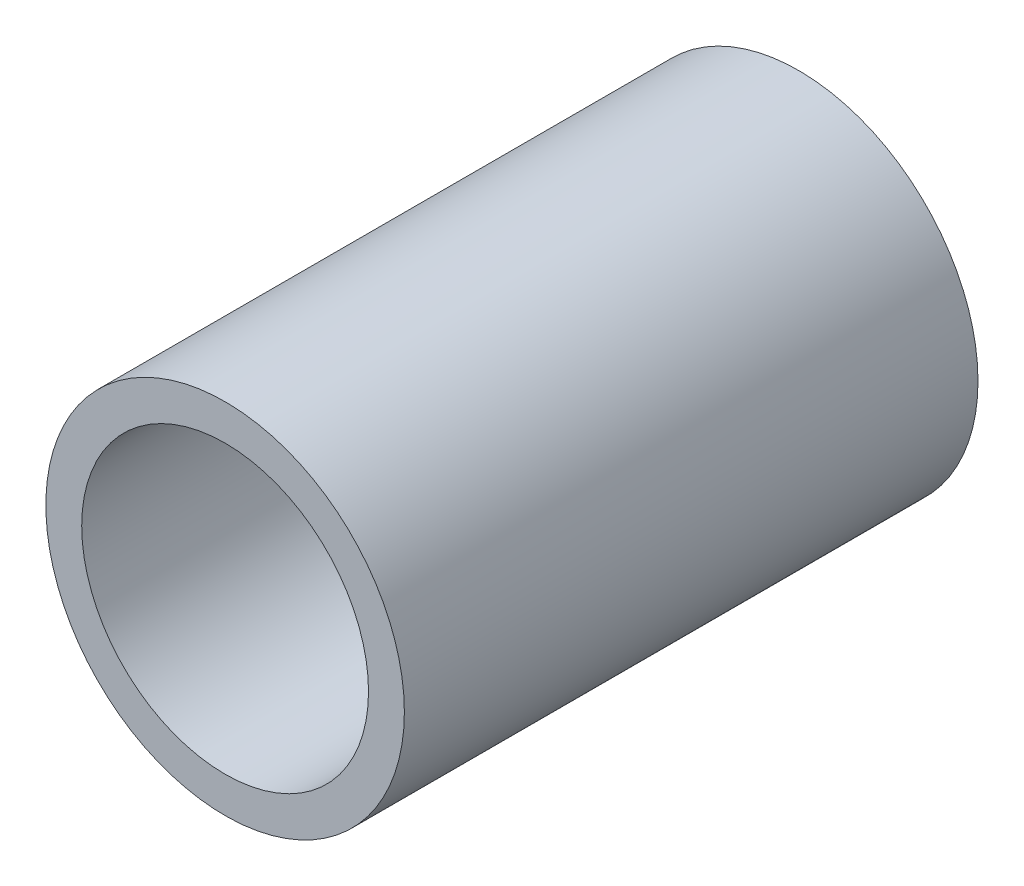
ISO-10303-21;
HEADER;
FILE_DESCRIPTION(('STEP AP214'),'2;1');
FILE_NAME('part.step','',(''),(''),'','','');
FILE_SCHEMA(('AUTOMOTIVE_DESIGN { 1 0 10303 214 1 1 1 1 }'));
ENDSEC;
DATA;
#1=APPLICATION_CONTEXT('core data for automotive mechanical design processes');
#2=APPLICATION_PROTOCOL_DEFINITION('international standard','automotive_design',2000,#1);
#3=PRODUCT_CONTEXT('',#1,'mechanical');
#4=PRODUCT('Part','Part','',(#3));
#5=PRODUCT_RELATED_PRODUCT_CATEGORY('part','',(#4));
#6=PRODUCT_DEFINITION_FORMATION('','',#4);
#7=PRODUCT_DEFINITION_CONTEXT('part definition',#1,'design');
#8=PRODUCT_DEFINITION('design','',#6,#7);
#9=PRODUCT_DEFINITION_SHAPE('','',#8);
#10=(LENGTH_UNIT() NAMED_UNIT(*) SI_UNIT(.MILLI.,.METRE.));
#11=(NAMED_UNIT(*) PLANE_ANGLE_UNIT() SI_UNIT($,.RADIAN.));
#12=(NAMED_UNIT(*) SI_UNIT($,.STERADIAN.) SOLID_ANGLE_UNIT());
#13=UNCERTAINTY_MEASURE_WITH_UNIT(LENGTH_MEASURE(1.E-05),#10,'distance_accuracy_value','');
#14=(GEOMETRIC_REPRESENTATION_CONTEXT(3) GLOBAL_UNCERTAINTY_ASSIGNED_CONTEXT((#13)) GLOBAL_UNIT_ASSIGNED_CONTEXT((#10,
#11,#12)) REPRESENTATION_CONTEXT('',''));
#15=CARTESIAN_POINT('',(0.,0.,0.));
#16=DIRECTION('',(0.,0.,1.));
#17=DIRECTION('',(1.,0.,0.));
#18=AXIS2_PLACEMENT_3D('',#15,#16,#17);
#19=CARTESIAN_POINT('',(0.,0.,12.7));
#20=DIRECTION('',(0.,0.,1.));
#21=DIRECTION('',(1.,0.,0.));
#22=AXIS2_PLACEMENT_3D('',#19,#20,#21);
#23=PLANE('',#22);
#24=CARTESIAN_POINT('',(0.,0.,12.7));
#25=DIRECTION('',(0.,0.,1.));
#26=DIRECTION('',(1.,0.,0.));
#27=AXIS2_PLACEMENT_3D('',#24,#25,#26);
#28=CIRCLE('',#27,3.96875);
#29=CARTESIAN_POINT('',(3.96875,0.,12.7));
#30=VERTEX_POINT('',#29);
#31=EDGE_CURVE('E10',#30,#30,#28,.T.);
#32=ORIENTED_EDGE('',*,*,#31,.T.);
#33=EDGE_LOOP('',(#32));
#34=FACE_BOUND('',#33,.T.);
#35=CARTESIAN_POINT('',(0.,0.,12.7));
#36=DIRECTION('',(0.,0.,1.));
#37=DIRECTION('',(1.,0.,0.));
#38=AXIS2_PLACEMENT_3D('',#35,#36,#37);
#39=CIRCLE('',#38,3.175);
#40=CARTESIAN_POINT('',(3.175,0.,12.7));
#41=VERTEX_POINT('',#40);
#42=EDGE_CURVE('E41',#41,#41,#39,.T.);
#43=ORIENTED_EDGE('',*,*,#42,.F.);
#44=EDGE_LOOP('',(#43));
#45=FACE_BOUND('',#44,.T.);
#46=ADVANCED_FACE('F30',(#34,#45),#23,.T.);
#47=CARTESIAN_POINT('',(0.,0.,0.));
#48=DIRECTION('',(0.,0.,1.));
#49=DIRECTION('',(1.,0.,0.));
#50=AXIS2_PLACEMENT_3D('',#47,#48,#49);
#51=PLANE('',#50);
#52=CARTESIAN_POINT('',(0.,0.,0.));
#53=DIRECTION('',(0.,0.,1.));
#54=DIRECTION('',(1.,0.,0.));
#55=AXIS2_PLACEMENT_3D('',#52,#53,#54);
#56=CIRCLE('',#55,3.96875);
#57=CARTESIAN_POINT('',(3.96875,0.,0.));
#58=VERTEX_POINT('',#57);
#59=EDGE_CURVE('E34',#58,#58,#56,.T.);
#60=ORIENTED_EDGE('',*,*,#59,.F.);
#61=EDGE_LOOP('',(#60));
#62=FACE_BOUND('',#61,.T.);
#63=CARTESIAN_POINT('',(0.,0.,0.));
#64=DIRECTION('',(0.,0.,1.));
#65=DIRECTION('',(1.,0.,0.));
#66=AXIS2_PLACEMENT_3D('',#63,#64,#65);
#67=CIRCLE('',#66,3.175);
#68=CARTESIAN_POINT('',(3.175,0.,0.));
#69=VERTEX_POINT('',#68);
#70=EDGE_CURVE('E43',#69,#69,#67,.T.);
#71=ORIENTED_EDGE('',*,*,#70,.T.);
#72=EDGE_LOOP('',(#71));
#73=FACE_BOUND('',#72,.T.);
#74=ADVANCED_FACE('F53',(#62,#73),#51,.F.);
#75=CARTESIAN_POINT('',(0.,0.,12.7));
#76=DIRECTION('',(0.,0.,-1.));
#77=DIRECTION('',(-1.,0.,0.));
#78=AXIS2_PLACEMENT_3D('',#75,#76,#77);
#79=CYLINDRICAL_SURFACE('',#78,3.96875);
#80=ORIENTED_EDGE('',*,*,#31,.F.);
#81=EDGE_LOOP('',(#80));
#82=FACE_BOUND('',#81,.T.);
#83=ORIENTED_EDGE('',*,*,#59,.T.);
#84=EDGE_LOOP('',(#83));
#85=FACE_BOUND('',#84,.T.);
#86=ADVANCED_FACE('F32',(#82,#85),#79,.T.);
#87=CARTESIAN_POINT('',(0.,0.,12.7));
#88=DIRECTION('',(0.,0.,-1.));
#89=DIRECTION('',(-1.,0.,0.));
#90=AXIS2_PLACEMENT_3D('',#87,#88,#89);
#91=CYLINDRICAL_SURFACE('',#90,3.175);
#92=ORIENTED_EDGE('',*,*,#42,.T.);
#93=EDGE_LOOP('',(#92));
#94=FACE_BOUND('',#93,.T.);
#95=ORIENTED_EDGE('',*,*,#70,.F.);
#96=EDGE_LOOP('',(#95));
#97=FACE_BOUND('',#96,.T.);
#98=ADVANCED_FACE('F49',(#94,#97),#91,.F.);
#99=CLOSED_SHELL('',(#46,#74,#86,#98));
#100=MANIFOLD_SOLID_BREP('B2',#99);
#101=ADVANCED_BREP_SHAPE_REPRESENTATION('',(#18,#100),#14);
#102=SHAPE_DEFINITION_REPRESENTATION(#9,#101);
ENDSEC;
END-ISO-10303-21;
